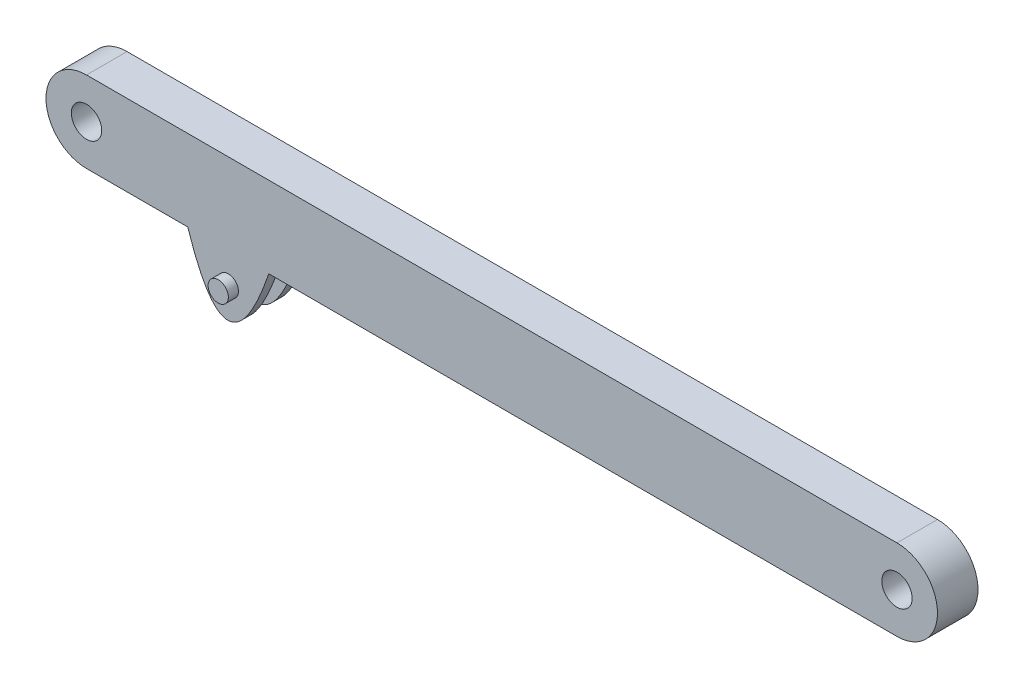
ISO-10303-21;
HEADER;
FILE_DESCRIPTION(('STEP AP214'),'2;1');
FILE_NAME('part.step','',(''),(''),'','','');
FILE_SCHEMA(('AUTOMOTIVE_DESIGN { 1 0 10303 214 1 1 1 1 }'));
ENDSEC;
DATA;
#1=APPLICATION_CONTEXT('core data for automotive mechanical design processes');
#2=APPLICATION_PROTOCOL_DEFINITION('international standard','automotive_design',2000,#1);
#3=PRODUCT_CONTEXT('',#1,'mechanical');
#4=PRODUCT('Part','Part','',(#3));
#5=PRODUCT_RELATED_PRODUCT_CATEGORY('part','',(#4));
#6=PRODUCT_DEFINITION_FORMATION('','',#4);
#7=PRODUCT_DEFINITION_CONTEXT('part definition',#1,'design');
#8=PRODUCT_DEFINITION('design','',#6,#7);
#9=PRODUCT_DEFINITION_SHAPE('','',#8);
#10=(LENGTH_UNIT() NAMED_UNIT(*) SI_UNIT(.MILLI.,.METRE.));
#11=(NAMED_UNIT(*) PLANE_ANGLE_UNIT() SI_UNIT($,.RADIAN.));
#12=(NAMED_UNIT(*) SI_UNIT($,.STERADIAN.) SOLID_ANGLE_UNIT());
#13=UNCERTAINTY_MEASURE_WITH_UNIT(LENGTH_MEASURE(1.E-05),#10,'distance_accuracy_value','');
#14=(GEOMETRIC_REPRESENTATION_CONTEXT(3) GLOBAL_UNCERTAINTY_ASSIGNED_CONTEXT((#13)) GLOBAL_UNIT_ASSIGNED_CONTEXT((#10,
#11,#12)) REPRESENTATION_CONTEXT('',''));
#15=CARTESIAN_POINT('',(0.,0.,0.));
#16=DIRECTION('',(0.,0.,1.));
#17=DIRECTION('',(1.,0.,0.));
#18=AXIS2_PLACEMENT_3D('',#15,#16,#17);
#19=CARTESIAN_POINT('',(-200.,0.,20.));
#20=DIRECTION('',(0.,0.,1.));
#21=DIRECTION('',(1.,0.,0.));
#22=AXIS2_PLACEMENT_3D('',#19,#20,#21);
#23=PLANE('',#22);
#24=CARTESIAN_POINT('',(-200.,0.,20.));
#25=DIRECTION('',(0.,0.,1.));
#26=DIRECTION('',(1.,0.,0.));
#27=AXIS2_PLACEMENT_3D('',#24,#25,#26);
#28=CIRCLE('',#27,20.);
#29=CARTESIAN_POINT('',(-200.,20.,20.));
#30=VERTEX_POINT('',#29);
#31=CARTESIAN_POINT('',(-200.,-20.,20.));
#32=VERTEX_POINT('',#31);
#33=EDGE_CURVE('E257',#30,#32,#28,.T.);
#34=ORIENTED_EDGE('',*,*,#33,.T.);
#35=DIRECTION('',(1.,0.,0.));
#36=VECTOR('',#35,1.);
#37=CARTESIAN_POINT('',(-200.,-20.,20.));
#38=LINE('',#37,#36);
#39=CARTESIAN_POINT('',(-150.037555005749,-20.,20.));
#40=VERTEX_POINT('',#39);
#41=EDGE_CURVE('E302',#32,#40,#38,.T.);
#42=ORIENTED_EDGE('',*,*,#41,.T.);
#43=CARTESIAN_POINT('',(-150.037555005749,-20.,20.));
#44=CARTESIAN_POINT('',(-130.493208153049,-80.0015376287906,20.));
#45=CARTESIAN_POINT('',(-110.037555005749,-20.,20.));
#46=B_SPLINE_CURVE_WITH_KNOTS('',2,(#43,#44,#45),.UNSPECIFIED.,.F.,.F.,(3,3),(0.,1.),.UNSPECIFIED.);
#47=CARTESIAN_POINT('',(-110.037555005749,-20.,20.));
#48=VERTEX_POINT('',#47);
#49=EDGE_CURVE('E54',#40,#48,#46,.T.);
#50=ORIENTED_EDGE('',*,*,#49,.T.);
#51=CARTESIAN_POINT('',(200.,-19.9999999999999,20.));
#52=VERTEX_POINT('',#51);
#53=EDGE_CURVE('E301',#48,#52,#38,.T.);
#54=ORIENTED_EDGE('',*,*,#53,.T.);
#55=CARTESIAN_POINT('',(200.,0.,20.));
#56=DIRECTION('',(0.,0.,1.));
#57=DIRECTION('',(1.,0.,0.));
#58=AXIS2_PLACEMENT_3D('',#55,#56,#57);
#59=CIRCLE('',#58,20.);
#60=CARTESIAN_POINT('',(200.,20.0000000000001,20.));
#61=VERTEX_POINT('',#60);
#62=EDGE_CURVE('E304',#52,#61,#59,.T.);
#63=ORIENTED_EDGE('',*,*,#62,.T.);
#64=DIRECTION('',(-1.,0.,0.));
#65=VECTOR('',#64,1.);
#66=CARTESIAN_POINT('',(-200.,20.,20.));
#67=LINE('',#66,#65);
#68=EDGE_CURVE('E249',#61,#30,#67,.T.);
#69=ORIENTED_EDGE('',*,*,#68,.T.);
#70=EDGE_LOOP('',(#34,#42,#50,#54,#63,#69));
#71=FACE_BOUND('',#70,.T.);
#72=CARTESIAN_POINT('',(200.,0.,20.));
#73=DIRECTION('',(0.,0.,1.));
#74=DIRECTION('',(1.,0.,0.));
#75=AXIS2_PLACEMENT_3D('',#72,#73,#74);
#76=CIRCLE('',#75,7.50000000000001);
#77=CARTESIAN_POINT('',(207.5,0.,20.));
#78=VERTEX_POINT('',#77);
#79=EDGE_CURVE('E246',#78,#78,#76,.T.);
#80=ORIENTED_EDGE('',*,*,#79,.F.);
#81=EDGE_LOOP('',(#80));
#82=FACE_BOUND('',#81,.T.);
#83=CARTESIAN_POINT('',(-200.,0.,20.));
#84=DIRECTION('',(0.,0.,1.));
#85=DIRECTION('',(1.,0.,0.));
#86=AXIS2_PLACEMENT_3D('',#83,#84,#85);
#87=CIRCLE('',#86,7.50000000000001);
#88=CARTESIAN_POINT('',(-192.5,0.,20.));
#89=VERTEX_POINT('',#88);
#90=EDGE_CURVE('E288',#89,#89,#87,.T.);
#91=ORIENTED_EDGE('',*,*,#90,.F.);
#92=EDGE_LOOP('',(#91));
#93=FACE_BOUND('',#92,.T.);
#94=CARTESIAN_POINT('',(-130.,-35.,20.));
#95=DIRECTION('',(0.,0.,1.));
#96=DIRECTION('',(1.,0.,0.));
#97=AXIS2_PLACEMENT_3D('',#94,#95,#96);
#98=CIRCLE('',#97,4.99999999999999);
#99=CARTESIAN_POINT('',(-125.,-35.,20.));
#100=VERTEX_POINT('',#99);
#101=EDGE_CURVE('E136',#100,#100,#98,.F.);
#102=ORIENTED_EDGE('',*,*,#101,.T.);
#103=EDGE_LOOP('',(#102));
#104=FACE_BOUND('',#103,.T.);
#105=ADVANCED_FACE('F38',(#71,#82,#93,#104),#23,.T.);
#106=CARTESIAN_POINT('',(-130.265381579399,-50.0007688143953,15.));
#107=DIRECTION('',(0.,0.,1.));
#108=DIRECTION('',(-1.,0.,0.));
#109=AXIS2_PLACEMENT_3D('',#106,#107,#108);
#110=PLANE('',#109);
#111=CARTESIAN_POINT('',(-150.037555005749,-20.,15.));
#112=CARTESIAN_POINT('',(-130.493208153049,-80.0015376287906,15.));
#113=CARTESIAN_POINT('',(-110.037555005749,-20.,15.));
#114=B_SPLINE_CURVE_WITH_KNOTS('',2,(#111,#112,#113),.UNSPECIFIED.,.F.,.F.,(3,3),(0.,1.),.UNSPECIFIED.);
#115=CARTESIAN_POINT('',(-150.037555005749,-20.,15.));
#116=VERTEX_POINT('',#115);
#117=CARTESIAN_POINT('',(-110.037555005749,-20.,15.));
#118=VERTEX_POINT('',#117);
#119=EDGE_CURVE('E106',#116,#118,#114,.T.);
#120=ORIENTED_EDGE('',*,*,#119,.F.);
#121=DIRECTION('',(-1.,0.,0.));
#122=VECTOR('',#121,1.);
#123=CARTESIAN_POINT('',(-150.037555005749,-20.,15.));
#124=LINE('',#123,#122);
#125=EDGE_CURVE('E116',#118,#116,#124,.T.);
#126=ORIENTED_EDGE('',*,*,#125,.F.);
#127=EDGE_LOOP('',(#120,#126));
#128=FACE_BOUND('',#127,.T.);
#129=CARTESIAN_POINT('',(-130.,-35.,15.));
#130=DIRECTION('',(0.,0.,1.));
#131=DIRECTION('',(1.,0.,0.));
#132=AXIS2_PLACEMENT_3D('',#129,#130,#131);
#133=CIRCLE('',#132,4.99999999999999);
#134=CARTESIAN_POINT('',(-125.,-35.,15.));
#135=VERTEX_POINT('',#134);
#136=EDGE_CURVE('E11',#135,#135,#133,.F.);
#137=ORIENTED_EDGE('',*,*,#136,.F.);
#138=EDGE_LOOP('',(#137));
#139=FACE_BOUND('',#138,.T.);
#140=ADVANCED_FACE('F114',(#128,#139),#110,.F.);
#141=CARTESIAN_POINT('',(-200.,-20.,20.));
#142=DIRECTION('',(0.,1.,0.));
#143=DIRECTION('',(-1.,0.,0.));
#144=AXIS2_PLACEMENT_3D('',#141,#142,#143);
#145=PLANE('',#144);
#146=ORIENTED_EDGE('',*,*,#125,.T.);
#147=DIRECTION('',(0.,0.,1.));
#148=VECTOR('',#147,1.);
#149=CARTESIAN_POINT('',(-150.037555005749,-20.,15.));
#150=LINE('',#149,#148);
#151=EDGE_CURVE('E103',#116,#40,#150,.T.);
#152=ORIENTED_EDGE('',*,*,#151,.T.);
#153=ORIENTED_EDGE('',*,*,#41,.F.);
#154=DIRECTION('',(0.,0.,-1.));
#155=VECTOR('',#154,1.);
#156=CARTESIAN_POINT('',(-200.,-20.,20.));
#157=LINE('',#156,#155);
#158=CARTESIAN_POINT('',(-200.,-20.,0.));
#159=VERTEX_POINT('',#158);
#160=EDGE_CURVE('E47',#32,#159,#157,.T.);
#161=ORIENTED_EDGE('',*,*,#160,.T.);
#162=DIRECTION('',(1.,0.,0.));
#163=VECTOR('',#162,1.);
#164=CARTESIAN_POINT('',(-200.,-20.,0.));
#165=LINE('',#164,#163);
#166=CARTESIAN_POINT('',(-150.037555005749,-20.,0.));
#167=VERTEX_POINT('',#166);
#168=EDGE_CURVE('E236',#159,#167,#165,.T.);
#169=ORIENTED_EDGE('',*,*,#168,.T.);
#170=DIRECTION('',(0.,0.,-1.));
#171=VECTOR('',#170,1.);
#172=CARTESIAN_POINT('',(-150.037555005749,-20.,5.));
#173=LINE('',#172,#171);
#174=CARTESIAN_POINT('',(-150.037555005749,-20.,5.));
#175=VERTEX_POINT('',#174);
#176=EDGE_CURVE('E62',#175,#167,#173,.T.);
#177=ORIENTED_EDGE('',*,*,#176,.F.);
#178=DIRECTION('',(-1.,0.,0.));
#179=VECTOR('',#178,1.);
#180=CARTESIAN_POINT('',(-150.037555005749,-20.,5.));
#181=LINE('',#180,#179);
#182=CARTESIAN_POINT('',(-110.037555005749,-20.,5.));
#183=VERTEX_POINT('',#182);
#184=EDGE_CURVE('E157',#183,#175,#181,.T.);
#185=ORIENTED_EDGE('',*,*,#184,.F.);
#186=DIRECTION('',(0.,0.,-1.));
#187=VECTOR('',#186,1.);
#188=CARTESIAN_POINT('',(-110.037555005749,-20.,5.));
#189=LINE('',#188,#187);
#190=CARTESIAN_POINT('',(-110.037555005749,-20.,0.));
#191=VERTEX_POINT('',#190);
#192=EDGE_CURVE('E284',#183,#191,#189,.T.);
#193=ORIENTED_EDGE('',*,*,#192,.T.);
#194=CARTESIAN_POINT('',(200.,-19.9999999999999,0.));
#195=VERTEX_POINT('',#194);
#196=EDGE_CURVE('E241',#191,#195,#165,.T.);
#197=ORIENTED_EDGE('',*,*,#196,.T.);
#198=DIRECTION('',(0.,0.,-1.));
#199=VECTOR('',#198,1.);
#200=CARTESIAN_POINT('',(200.,-19.9999999999999,20.));
#201=LINE('',#200,#199);
#202=EDGE_CURVE('E265',#52,#195,#201,.T.);
#203=ORIENTED_EDGE('',*,*,#202,.F.);
#204=ORIENTED_EDGE('',*,*,#53,.F.);
#205=DIRECTION('',(0.,0.,1.));
#206=VECTOR('',#205,1.);
#207=CARTESIAN_POINT('',(-110.037555005749,-20.,15.));
#208=LINE('',#207,#206);
#209=EDGE_CURVE('E111',#118,#48,#208,.T.);
#210=ORIENTED_EDGE('',*,*,#209,.F.);
#211=EDGE_LOOP('',(#146,#152,#153,#161,#169,#177,#185,#193,#197,#203,#204,#210));
#212=FACE_BOUND('',#211,.T.);
#213=ADVANCED_FACE('F120',(#212),#145,.F.);
#214=CARTESIAN_POINT('',(-200.,0.,20.));
#215=DIRECTION('',(0.,0.,-1.));
#216=DIRECTION('',(-1.,0.,0.));
#217=AXIS2_PLACEMENT_3D('',#214,#215,#216);
#218=CYLINDRICAL_SURFACE('',#217,20.);
#219=CARTESIAN_POINT('',(-200.,0.,0.));
#220=DIRECTION('',(0.,0.,1.));
#221=DIRECTION('',(1.,0.,0.));
#222=AXIS2_PLACEMENT_3D('',#219,#220,#221);
#223=CIRCLE('',#222,20.);
#224=CARTESIAN_POINT('',(-200.,20.,0.));
#225=VERTEX_POINT('',#224);
#226=EDGE_CURVE('E232',#225,#159,#223,.T.);
#227=ORIENTED_EDGE('',*,*,#226,.T.);
#228=ORIENTED_EDGE('',*,*,#160,.F.);
#229=ORIENTED_EDGE('',*,*,#33,.F.);
#230=DIRECTION('',(0.,0.,-1.));
#231=VECTOR('',#230,1.);
#232=CARTESIAN_POINT('',(-200.,20.,20.));
#233=LINE('',#232,#231);
#234=EDGE_CURVE('E258',#30,#225,#233,.T.);
#235=ORIENTED_EDGE('',*,*,#234,.T.);
#236=EDGE_LOOP('',(#227,#228,#229,#235));
#237=FACE_BOUND('',#236,.T.);
#238=ADVANCED_FACE('F40',(#237),#218,.T.);
#239=CARTESIAN_POINT('',(200.,0.,20.));
#240=DIRECTION('',(0.,0.,-1.));
#241=DIRECTION('',(-1.,0.,0.));
#242=AXIS2_PLACEMENT_3D('',#239,#240,#241);
#243=CYLINDRICAL_SURFACE('',#242,20.);
#244=CARTESIAN_POINT('',(200.,0.,0.));
#245=DIRECTION('',(0.,0.,1.));
#246=DIRECTION('',(1.,0.,0.));
#247=AXIS2_PLACEMENT_3D('',#244,#245,#246);
#248=CIRCLE('',#247,20.);
#249=CARTESIAN_POINT('',(200.,20.0000000000001,0.));
#250=VERTEX_POINT('',#249);
#251=EDGE_CURVE('E252',#195,#250,#248,.T.);
#252=ORIENTED_EDGE('',*,*,#251,.T.);
#253=DIRECTION('',(0.,0.,-1.));
#254=VECTOR('',#253,1.);
#255=CARTESIAN_POINT('',(200.,20.0000000000001,20.));
#256=LINE('',#255,#254);
#257=EDGE_CURVE('E261',#61,#250,#256,.T.);
#258=ORIENTED_EDGE('',*,*,#257,.F.);
#259=ORIENTED_EDGE('',*,*,#62,.F.);
#260=ORIENTED_EDGE('',*,*,#202,.T.);
#261=EDGE_LOOP('',(#252,#258,#259,#260));
#262=FACE_BOUND('',#261,.T.);
#263=ADVANCED_FACE('F187',(#262),#243,.T.);
#264=CARTESIAN_POINT('',(-200.,20.,20.));
#265=DIRECTION('',(0.,-1.,0.));
#266=DIRECTION('',(1.,0.,0.));
#267=AXIS2_PLACEMENT_3D('',#264,#265,#266);
#268=PLANE('',#267);
#269=DIRECTION('',(-1.,0.,0.));
#270=VECTOR('',#269,1.);
#271=CARTESIAN_POINT('',(-200.,20.,0.));
#272=LINE('',#271,#270);
#273=EDGE_CURVE('E234',#250,#225,#272,.T.);
#274=ORIENTED_EDGE('',*,*,#273,.T.);
#275=ORIENTED_EDGE('',*,*,#234,.F.);
#276=ORIENTED_EDGE('',*,*,#68,.F.);
#277=ORIENTED_EDGE('',*,*,#257,.T.);
#278=EDGE_LOOP('',(#274,#275,#276,#277));
#279=FACE_BOUND('',#278,.T.);
#280=ADVANCED_FACE('F183',(#279),#268,.F.);
#281=CARTESIAN_POINT('',(-200.,0.,0.));
#282=DIRECTION('',(0.,0.,1.));
#283=DIRECTION('',(1.,0.,0.));
#284=AXIS2_PLACEMENT_3D('',#281,#282,#283);
#285=PLANE('',#284);
#286=CARTESIAN_POINT('',(-130.,-35.,0.));
#287=DIRECTION('',(0.,0.,1.));
#288=DIRECTION('',(1.,0.,0.));
#289=AXIS2_PLACEMENT_3D('',#286,#287,#288);
#290=CIRCLE('',#289,4.99999999999999);
#291=CARTESIAN_POINT('',(-125.,-35.,0.));
#292=VERTEX_POINT('',#291);
#293=EDGE_CURVE('E145',#292,#292,#290,.T.);
#294=ORIENTED_EDGE('',*,*,#293,.T.);
#295=EDGE_LOOP('',(#294));
#296=FACE_BOUND('',#295,.T.);
#297=CARTESIAN_POINT('',(-200.,0.,0.));
#298=DIRECTION('',(0.,0.,1.));
#299=DIRECTION('',(1.,0.,0.));
#300=AXIS2_PLACEMENT_3D('',#297,#298,#299);
#301=CIRCLE('',#300,7.50000000000001);
#302=CARTESIAN_POINT('',(-192.5,0.,0.));
#303=VERTEX_POINT('',#302);
#304=EDGE_CURVE('E224',#303,#303,#301,.T.);
#305=ORIENTED_EDGE('',*,*,#304,.T.);
#306=EDGE_LOOP('',(#305));
#307=FACE_BOUND('',#306,.T.);
#308=CARTESIAN_POINT('',(200.,0.,0.));
#309=DIRECTION('',(0.,0.,1.));
#310=DIRECTION('',(1.,0.,0.));
#311=AXIS2_PLACEMENT_3D('',#308,#309,#310);
#312=CIRCLE('',#311,7.50000000000001);
#313=CARTESIAN_POINT('',(207.5,0.,0.));
#314=VERTEX_POINT('',#313);
#315=EDGE_CURVE('E228',#314,#314,#312,.T.);
#316=ORIENTED_EDGE('',*,*,#315,.T.);
#317=EDGE_LOOP('',(#316));
#318=FACE_BOUND('',#317,.T.);
#319=ORIENTED_EDGE('',*,*,#226,.F.);
#320=ORIENTED_EDGE('',*,*,#273,.F.);
#321=ORIENTED_EDGE('',*,*,#251,.F.);
#322=ORIENTED_EDGE('',*,*,#196,.F.);
#323=CARTESIAN_POINT('',(-150.037555005749,-20.,0.));
#324=CARTESIAN_POINT('',(-130.493208153049,-80.0015376287906,0.));
#325=CARTESIAN_POINT('',(-110.037555005749,-20.,0.));
#326=B_SPLINE_CURVE_WITH_KNOTS('',2,(#323,#324,#325),.UNSPECIFIED.,.F.,.F.,(3,3),(0.,1.),.UNSPECIFIED.);
#327=EDGE_CURVE('E149',#167,#191,#326,.T.);
#328=ORIENTED_EDGE('',*,*,#327,.F.);
#329=ORIENTED_EDGE('',*,*,#168,.F.);
#330=EDGE_LOOP('',(#319,#320,#321,#322,#328,#329));
#331=FACE_BOUND('',#330,.T.);
#332=ADVANCED_FACE('F177',(#296,#307,#318,#331),#285,.F.);
#333=CARTESIAN_POINT('',(200.,0.,0.));
#334=DIRECTION('',(0.,0.,1.));
#335=DIRECTION('',(1.,0.,0.));
#336=AXIS2_PLACEMENT_3D('',#333,#334,#335);
#337=CYLINDRICAL_SURFACE('',#336,7.50000000000001);
#338=ORIENTED_EDGE('',*,*,#315,.F.);
#339=EDGE_LOOP('',(#338));
#340=FACE_BOUND('',#339,.T.);
#341=ORIENTED_EDGE('',*,*,#79,.T.);
#342=EDGE_LOOP('',(#341));
#343=FACE_BOUND('',#342,.T.);
#344=ADVANCED_FACE('F173',(#340,#343),#337,.F.);
#345=CARTESIAN_POINT('',(-200.,0.,0.));
#346=DIRECTION('',(0.,0.,1.));
#347=DIRECTION('',(1.,0.,0.));
#348=AXIS2_PLACEMENT_3D('',#345,#346,#347);
#349=CYLINDRICAL_SURFACE('',#348,7.50000000000001);
#350=ORIENTED_EDGE('',*,*,#304,.F.);
#351=EDGE_LOOP('',(#350));
#352=FACE_BOUND('',#351,.T.);
#353=ORIENTED_EDGE('',*,*,#90,.T.);
#354=EDGE_LOOP('',(#353));
#355=FACE_BOUND('',#354,.T.);
#356=ADVANCED_FACE('F168',(#352,#355),#349,.F.);
#357=CARTESIAN_POINT('',(-150.037555005749,-20.,5.));
#358=CARTESIAN_POINT('',(-130.493208153049,-80.0015376287906,5.));
#359=CARTESIAN_POINT('',(-110.037555005749,-20.,5.));
#360=B_SPLINE_CURVE_WITH_KNOTS('',2,(#357,#358,#359),.UNSPECIFIED.,.F.,.F.,(3,3),(0.,1.),.UNSPECIFIED.);
#361=DIRECTION('',(0.,0.,-1.));
#362=VECTOR('',#361,1.);
#363=SURFACE_OF_LINEAR_EXTRUSION('',#360,#362);
#364=ORIENTED_EDGE('',*,*,#327,.T.);
#365=ORIENTED_EDGE('',*,*,#192,.F.);
#366=EDGE_CURVE('E150',#175,#183,#360,.T.);
#367=ORIENTED_EDGE('',*,*,#366,.F.);
#368=ORIENTED_EDGE('',*,*,#176,.T.);
#369=EDGE_LOOP('',(#364,#365,#367,#368));
#370=FACE_BOUND('',#369,.T.);
#371=ADVANCED_FACE('F163',(#370),#363,.F.);
#372=CARTESIAN_POINT('',(-130.265381579399,-50.0007688143953,5.));
#373=DIRECTION('',(0.,0.,-1.));
#374=DIRECTION('',(-1.,0.,0.));
#375=AXIS2_PLACEMENT_3D('',#372,#373,#374);
#376=PLANE('',#375);
#377=CARTESIAN_POINT('',(-130.,-35.,5.));
#378=DIRECTION('',(0.,0.,-1.));
#379=DIRECTION('',(-1.,0.,0.));
#380=AXIS2_PLACEMENT_3D('',#377,#378,#379);
#381=CIRCLE('',#380,4.99999999999999);
#382=CARTESIAN_POINT('',(-135.,-35.,5.));
#383=VERTEX_POINT('',#382);
#384=EDGE_CURVE('E144',#383,#383,#381,.T.);
#385=ORIENTED_EDGE('',*,*,#384,.T.);
#386=EDGE_LOOP('',(#385));
#387=FACE_BOUND('',#386,.T.);
#388=ORIENTED_EDGE('',*,*,#366,.T.);
#389=ORIENTED_EDGE('',*,*,#184,.T.);
#390=EDGE_LOOP('',(#388,#389));
#391=FACE_BOUND('',#390,.T.);
#392=ADVANCED_FACE('F167',(#387,#391),#376,.F.);
#393=CARTESIAN_POINT('',(-130.,-35.,-5.));
#394=DIRECTION('',(0.,0.,1.));
#395=DIRECTION('',(1.,0.,0.));
#396=AXIS2_PLACEMENT_3D('',#393,#394,#395);
#397=CYLINDRICAL_SURFACE('',#396,4.99999999999999);
#398=ORIENTED_EDGE('',*,*,#384,.F.);
#399=EDGE_LOOP('',(#398));
#400=FACE_BOUND('',#399,.T.);
#401=ORIENTED_EDGE('',*,*,#136,.T.);
#402=EDGE_LOOP('',(#401));
#403=FACE_BOUND('',#402,.T.);
#404=ADVANCED_FACE('F211',(#400,#403),#397,.T.);
#405=CARTESIAN_POINT('',(-130.,-35.,-5.));
#406=DIRECTION('',(0.,0.,1.));
#407=DIRECTION('',(1.,0.,0.));
#408=AXIS2_PLACEMENT_3D('',#405,#406,#407);
#409=CIRCLE('',#408,4.99999999999999);
#410=CARTESIAN_POINT('',(-125.,-35.,-5.));
#411=VERTEX_POINT('',#410);
#412=EDGE_CURVE('E110',#411,#411,#409,.T.);
#413=ORIENTED_EDGE('',*,*,#412,.T.);
#414=EDGE_LOOP('',(#413));
#415=FACE_BOUND('',#414,.T.);
#416=ORIENTED_EDGE('',*,*,#293,.F.);
#417=EDGE_LOOP('',(#416));
#418=FACE_BOUND('',#417,.T.);
#419=ADVANCED_FACE('F208',(#415,#418),#397,.T.);
#420=CARTESIAN_POINT('',(-130.,-35.,-5.));
#421=DIRECTION('',(0.,0.,1.));
#422=DIRECTION('',(1.,0.,0.));
#423=AXIS2_PLACEMENT_3D('',#420,#421,#422);
#424=PLANE('',#423);
#425=ORIENTED_EDGE('',*,*,#412,.F.);
#426=EDGE_LOOP('',(#425));
#427=FACE_BOUND('',#426,.T.);
#428=ADVANCED_FACE('F206',(#427),#424,.F.);
#429=DIRECTION('',(0.,0.,1.));
#430=VECTOR('',#429,1.);
#431=SURFACE_OF_LINEAR_EXTRUSION('',#114,#430);
#432=ORIENTED_EDGE('',*,*,#49,.F.);
#433=ORIENTED_EDGE('',*,*,#151,.F.);
#434=ORIENTED_EDGE('',*,*,#119,.T.);
#435=ORIENTED_EDGE('',*,*,#209,.T.);
#436=EDGE_LOOP('',(#432,#433,#434,#435));
#437=FACE_BOUND('',#436,.T.);
#438=ADVANCED_FACE('F105',(#437),#431,.T.);
#439=CARTESIAN_POINT('',(-130.,-35.,25.));
#440=DIRECTION('',(0.,0.,-1.));
#441=DIRECTION('',(-1.,0.,0.));
#442=AXIS2_PLACEMENT_3D('',#439,#440,#441);
#443=CYLINDRICAL_SURFACE('',#442,4.99999999999999);
#444=ORIENTED_EDGE('',*,*,#101,.F.);
#445=EDGE_LOOP('',(#444));
#446=FACE_BOUND('',#445,.T.);
#447=CARTESIAN_POINT('',(-130.,-35.,25.));
#448=DIRECTION('',(0.,0.,1.));
#449=DIRECTION('',(1.,0.,0.));
#450=AXIS2_PLACEMENT_3D('',#447,#448,#449);
#451=CIRCLE('',#450,4.99999999999999);
#452=CARTESIAN_POINT('',(-125.,-35.,25.));
#453=VERTEX_POINT('',#452);
#454=EDGE_CURVE('E320',#453,#453,#451,.T.);
#455=ORIENTED_EDGE('',*,*,#454,.F.);
#456=EDGE_LOOP('',(#455));
#457=FACE_BOUND('',#456,.T.);
#458=ADVANCED_FACE('F202',(#446,#457),#443,.T.);
#459=CARTESIAN_POINT('',(-130.,-35.,25.));
#460=DIRECTION('',(0.,0.,-1.));
#461=DIRECTION('',(1.,0.,0.));
#462=AXIS2_PLACEMENT_3D('',#459,#460,#461);
#463=PLANE('',#462);
#464=ORIENTED_EDGE('',*,*,#454,.T.);
#465=EDGE_LOOP('',(#464));
#466=FACE_BOUND('',#465,.T.);
#467=ADVANCED_FACE('F328',(#466),#463,.F.);
#468=CLOSED_SHELL('',(#105,#140,#213,#238,#263,#280,#332,#344,#356,#371,#392,#404,#419,#428,
#438,#458,#467));
#469=MANIFOLD_SOLID_BREP('B2',#468);
#470=ADVANCED_BREP_SHAPE_REPRESENTATION('',(#18,#469),#14);
#471=SHAPE_DEFINITION_REPRESENTATION(#9,#470);
ENDSEC;
END-ISO-10303-21;
